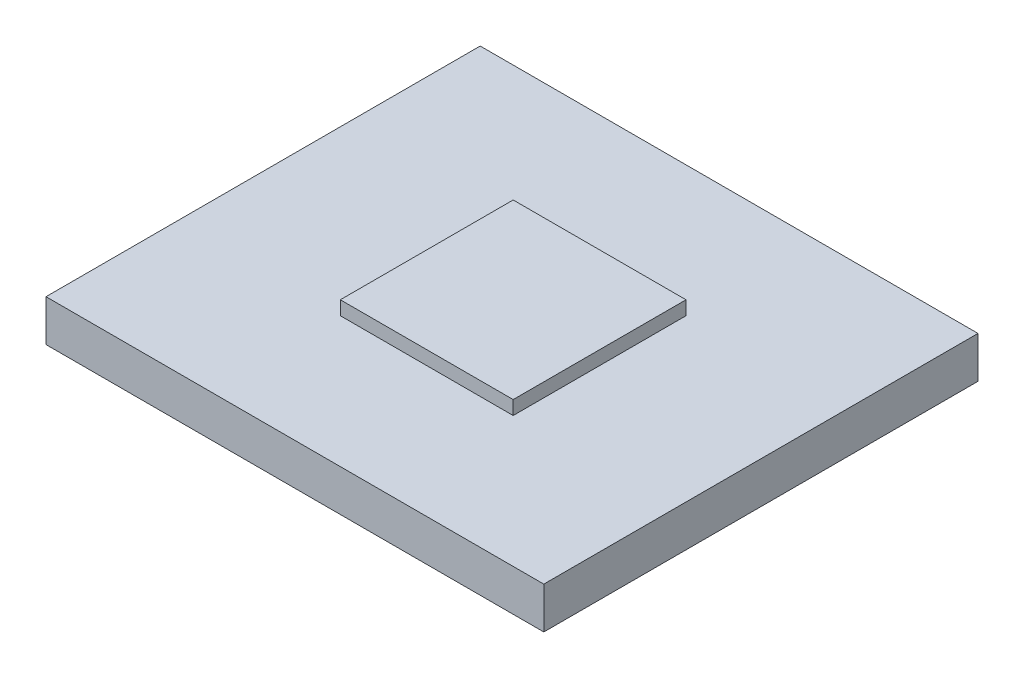
ISO-10303-21;
HEADER;
FILE_DESCRIPTION(('STEP AP214'),'2;1');
FILE_NAME('part.step','',(''),(''),'','','');
FILE_SCHEMA(('AUTOMOTIVE_DESIGN { 1 0 10303 214 1 1 1 1 }'));
ENDSEC;
DATA;
#1=APPLICATION_CONTEXT('core data for automotive mechanical design processes');
#2=APPLICATION_PROTOCOL_DEFINITION('international standard','automotive_design',2000,#1);
#3=PRODUCT_CONTEXT('',#1,'mechanical');
#4=PRODUCT('Part','Part','',(#3));
#5=PRODUCT_RELATED_PRODUCT_CATEGORY('part','',(#4));
#6=PRODUCT_DEFINITION_FORMATION('','',#4);
#7=PRODUCT_DEFINITION_CONTEXT('part definition',#1,'design');
#8=PRODUCT_DEFINITION('design','',#6,#7);
#9=PRODUCT_DEFINITION_SHAPE('','',#8);
#10=(LENGTH_UNIT() NAMED_UNIT(*) SI_UNIT(.MILLI.,.METRE.));
#11=(NAMED_UNIT(*) PLANE_ANGLE_UNIT() SI_UNIT($,.RADIAN.));
#12=(NAMED_UNIT(*) SI_UNIT($,.STERADIAN.) SOLID_ANGLE_UNIT());
#13=UNCERTAINTY_MEASURE_WITH_UNIT(LENGTH_MEASURE(1.E-05),#10,'distance_accuracy_value','');
#14=(GEOMETRIC_REPRESENTATION_CONTEXT(3) GLOBAL_UNCERTAINTY_ASSIGNED_CONTEXT((#13)) GLOBAL_UNIT_ASSIGNED_CONTEXT((#10,
#11,#12)) REPRESENTATION_CONTEXT('',''));
#15=CARTESIAN_POINT('',(0.,0.,0.));
#16=DIRECTION('',(0.,0.,1.));
#17=DIRECTION('',(1.,0.,0.));
#18=AXIS2_PLACEMENT_3D('',#15,#16,#17);
#19=CARTESIAN_POINT('',(0.,0.,0.));
#20=DIRECTION('',(0.,-1.,0.));
#21=DIRECTION('',(0.,0.,-1.));
#22=AXIS2_PLACEMENT_3D('',#19,#20,#21);
#23=PLANE('',#22);
#24=DIRECTION('',(-1.,0.,0.));
#25=VECTOR('',#24,1.);
#26=CARTESIAN_POINT('',(18.,0.,7.85));
#27=LINE('',#26,#25);
#28=CARTESIAN_POINT('',(18.,0.,7.85));
#29=VERTEX_POINT('',#28);
#30=CARTESIAN_POINT('',(0.,0.,7.85));
#31=VERTEX_POINT('',#30);
#32=EDGE_CURVE('E120',#29,#31,#27,.T.);
#33=ORIENTED_EDGE('',*,*,#32,.F.);
#34=DIRECTION('',(0.,0.,1.));
#35=VECTOR('',#34,1.);
#36=CARTESIAN_POINT('',(18.,0.,-7.85));
#37=LINE('',#36,#35);
#38=CARTESIAN_POINT('',(18.,0.,-7.85));
#39=VERTEX_POINT('',#38);
#40=EDGE_CURVE('E133',#39,#29,#37,.T.);
#41=ORIENTED_EDGE('',*,*,#40,.F.);
#42=DIRECTION('',(1.,0.,0.));
#43=VECTOR('',#42,1.);
#44=CARTESIAN_POINT('',(0.,0.,-7.85));
#45=LINE('',#44,#43);
#46=CARTESIAN_POINT('',(0.,0.,-7.85));
#47=VERTEX_POINT('',#46);
#48=EDGE_CURVE('E141',#47,#39,#45,.T.);
#49=ORIENTED_EDGE('',*,*,#48,.F.);
#50=DIRECTION('',(0.,0.,-1.));
#51=VECTOR('',#50,1.);
#52=CARTESIAN_POINT('',(0.,0.,7.85));
#53=LINE('',#52,#51);
#54=EDGE_CURVE('E123',#31,#47,#53,.T.);
#55=ORIENTED_EDGE('',*,*,#54,.F.);
#56=EDGE_LOOP('',(#33,#41,#49,#55));
#57=FACE_BOUND('',#56,.T.);
#58=DIRECTION('',(0.,0.,1.));
#59=VECTOR('',#58,1.);
#60=CARTESIAN_POINT('',(5.91771605031427,0.,3.125));
#61=LINE('',#60,#59);
#62=CARTESIAN_POINT('',(5.91771605031427,0.,-3.125));
#63=VERTEX_POINT('',#62);
#64=CARTESIAN_POINT('',(5.91771605031427,0.,3.125));
#65=VERTEX_POINT('',#64);
#66=EDGE_CURVE('E50',#63,#65,#61,.T.);
#67=ORIENTED_EDGE('',*,*,#66,.F.);
#68=DIRECTION('',(-1.,0.,0.));
#69=VECTOR('',#68,1.);
#70=CARTESIAN_POINT('',(5.91771605031427,0.,-3.125));
#71=LINE('',#70,#69);
#72=CARTESIAN_POINT('',(12.1677160503143,0.,-3.125));
#73=VERTEX_POINT('',#72);
#74=EDGE_CURVE('E54',#73,#63,#71,.T.);
#75=ORIENTED_EDGE('',*,*,#74,.F.);
#76=DIRECTION('',(0.,0.,-1.));
#77=VECTOR('',#76,1.);
#78=CARTESIAN_POINT('',(12.1677160503143,0.,-3.125));
#79=LINE('',#78,#77);
#80=CARTESIAN_POINT('',(12.1677160503143,0.,3.125));
#81=VERTEX_POINT('',#80);
#82=EDGE_CURVE('E262',#81,#73,#79,.T.);
#83=ORIENTED_EDGE('',*,*,#82,.F.);
#84=DIRECTION('',(1.,0.,0.));
#85=VECTOR('',#84,1.);
#86=CARTESIAN_POINT('',(12.1677160503143,0.,3.125));
#87=LINE('',#86,#85);
#88=EDGE_CURVE('E268',#65,#81,#87,.T.);
#89=ORIENTED_EDGE('',*,*,#88,.F.);
#90=EDGE_LOOP('',(#67,#75,#83,#89));
#91=FACE_BOUND('',#90,.T.);
#92=ADVANCED_FACE('F35',(#57,#91),#23,.F.);
#93=CARTESIAN_POINT('',(18.,-1.5,7.85));
#94=DIRECTION('',(0.,0.,-1.));
#95=DIRECTION('',(-1.,0.,0.));
#96=AXIS2_PLACEMENT_3D('',#93,#94,#95);
#97=PLANE('',#96);
#98=ORIENTED_EDGE('',*,*,#32,.T.);
#99=DIRECTION('',(0.,1.,0.));
#100=VECTOR('',#99,1.);
#101=CARTESIAN_POINT('',(0.,-1.5,7.85));
#102=LINE('',#101,#100);
#103=CARTESIAN_POINT('',(0.,-1.5,7.85));
#104=VERTEX_POINT('',#103);
#105=EDGE_CURVE('E11',#104,#31,#102,.T.);
#106=ORIENTED_EDGE('',*,*,#105,.F.);
#107=DIRECTION('',(-1.,0.,0.));
#108=VECTOR('',#107,1.);
#109=CARTESIAN_POINT('',(18.,-1.5,7.85));
#110=LINE('',#109,#108);
#111=CARTESIAN_POINT('',(18.,-1.5,7.85));
#112=VERTEX_POINT('',#111);
#113=EDGE_CURVE('E129',#112,#104,#110,.T.);
#114=ORIENTED_EDGE('',*,*,#113,.F.);
#115=DIRECTION('',(0.,1.,0.));
#116=VECTOR('',#115,1.);
#117=CARTESIAN_POINT('',(18.,-1.5,7.85));
#118=LINE('',#117,#116);
#119=EDGE_CURVE('E138',#112,#29,#118,.T.);
#120=ORIENTED_EDGE('',*,*,#119,.T.);
#121=EDGE_LOOP('',(#98,#106,#114,#120));
#122=FACE_BOUND('',#121,.T.);
#123=ADVANCED_FACE('F37',(#122),#97,.F.);
#124=CARTESIAN_POINT('',(0.,-1.5,7.85));
#125=DIRECTION('',(1.,0.,0.));
#126=DIRECTION('',(0.,0.,-1.));
#127=AXIS2_PLACEMENT_3D('',#124,#125,#126);
#128=PLANE('',#127);
#129=ORIENTED_EDGE('',*,*,#54,.T.);
#130=DIRECTION('',(0.,1.,0.));
#131=VECTOR('',#130,1.);
#132=CARTESIAN_POINT('',(0.,-1.5,-7.85));
#133=LINE('',#132,#131);
#134=CARTESIAN_POINT('',(0.,-1.5,-7.85));
#135=VERTEX_POINT('',#134);
#136=EDGE_CURVE('E43',#135,#47,#133,.T.);
#137=ORIENTED_EDGE('',*,*,#136,.F.);
#138=DIRECTION('',(0.,0.,-1.));
#139=VECTOR('',#138,1.);
#140=CARTESIAN_POINT('',(0.,-1.5,7.85));
#141=LINE('',#140,#139);
#142=EDGE_CURVE('E132',#104,#135,#141,.T.);
#143=ORIENTED_EDGE('',*,*,#142,.F.);
#144=ORIENTED_EDGE('',*,*,#105,.T.);
#145=EDGE_LOOP('',(#129,#137,#143,#144));
#146=FACE_BOUND('',#145,.T.);
#147=ADVANCED_FACE('F168',(#146),#128,.F.);
#148=CARTESIAN_POINT('',(0.,-1.5,-7.85));
#149=DIRECTION('',(0.,0.,1.));
#150=DIRECTION('',(1.,0.,0.));
#151=AXIS2_PLACEMENT_3D('',#148,#149,#150);
#152=PLANE('',#151);
#153=ORIENTED_EDGE('',*,*,#48,.T.);
#154=DIRECTION('',(0.,1.,0.));
#155=VECTOR('',#154,1.);
#156=CARTESIAN_POINT('',(18.,-1.5,-7.85));
#157=LINE('',#156,#155);
#158=CARTESIAN_POINT('',(18.,-1.5,-7.85));
#159=VERTEX_POINT('',#158);
#160=EDGE_CURVE('E146',#159,#39,#157,.T.);
#161=ORIENTED_EDGE('',*,*,#160,.F.);
#162=DIRECTION('',(1.,0.,0.));
#163=VECTOR('',#162,1.);
#164=CARTESIAN_POINT('',(0.,-1.5,-7.85));
#165=LINE('',#164,#163);
#166=EDGE_CURVE('E135',#135,#159,#165,.T.);
#167=ORIENTED_EDGE('',*,*,#166,.F.);
#168=ORIENTED_EDGE('',*,*,#136,.T.);
#169=EDGE_LOOP('',(#153,#161,#167,#168));
#170=FACE_BOUND('',#169,.T.);
#171=ADVANCED_FACE('F153',(#170),#152,.F.);
#172=CARTESIAN_POINT('',(18.,-1.5,-7.85));
#173=DIRECTION('',(-1.,0.,0.));
#174=DIRECTION('',(0.,0.,1.));
#175=AXIS2_PLACEMENT_3D('',#172,#173,#174);
#176=PLANE('',#175);
#177=ORIENTED_EDGE('',*,*,#40,.T.);
#178=ORIENTED_EDGE('',*,*,#119,.F.);
#179=DIRECTION('',(0.,0.,1.));
#180=VECTOR('',#179,1.);
#181=CARTESIAN_POINT('',(18.,-1.5,-7.85));
#182=LINE('',#181,#180);
#183=EDGE_CURVE('E137',#159,#112,#182,.T.);
#184=ORIENTED_EDGE('',*,*,#183,.F.);
#185=ORIENTED_EDGE('',*,*,#160,.T.);
#186=EDGE_LOOP('',(#177,#178,#184,#185));
#187=FACE_BOUND('',#186,.T.);
#188=ADVANCED_FACE('F161',(#187),#176,.F.);
#189=CARTESIAN_POINT('',(0.,-1.5,0.));
#190=DIRECTION('',(0.,-1.,0.));
#191=DIRECTION('',(0.,0.,-1.));
#192=AXIS2_PLACEMENT_3D('',#189,#190,#191);
#193=PLANE('',#192);
#194=ORIENTED_EDGE('',*,*,#113,.T.);
#195=ORIENTED_EDGE('',*,*,#142,.T.);
#196=ORIENTED_EDGE('',*,*,#166,.T.);
#197=ORIENTED_EDGE('',*,*,#183,.T.);
#198=EDGE_LOOP('',(#194,#195,#196,#197));
#199=FACE_BOUND('',#198,.T.);
#200=ADVANCED_FACE('F167',(#199),#193,.T.);
#201=CARTESIAN_POINT('',(5.91771605031427,0.5,3.125));
#202=DIRECTION('',(1.,0.,0.));
#203=DIRECTION('',(0.,0.,-1.));
#204=AXIS2_PLACEMENT_3D('',#201,#202,#203);
#205=PLANE('',#204);
#206=ORIENTED_EDGE('',*,*,#66,.T.);
#207=DIRECTION('',(0.,-1.,0.));
#208=VECTOR('',#207,1.);
#209=CARTESIAN_POINT('',(5.91771605031427,0.5,3.125));
#210=LINE('',#209,#208);
#211=CARTESIAN_POINT('',(5.91771605031427,0.5,3.125));
#212=VERTEX_POINT('',#211);
#213=EDGE_CURVE('E103',#212,#65,#210,.T.);
#214=ORIENTED_EDGE('',*,*,#213,.F.);
#215=DIRECTION('',(0.,0.,1.));
#216=VECTOR('',#215,1.);
#217=CARTESIAN_POINT('',(5.91771605031427,0.5,3.125));
#218=LINE('',#217,#216);
#219=CARTESIAN_POINT('',(5.91771605031427,0.5,-3.125));
#220=VERTEX_POINT('',#219);
#221=EDGE_CURVE('E109',#220,#212,#218,.T.);
#222=ORIENTED_EDGE('',*,*,#221,.F.);
#223=DIRECTION('',(0.,-1.,0.));
#224=VECTOR('',#223,1.);
#225=CARTESIAN_POINT('',(5.91771605031427,0.5,-3.125));
#226=LINE('',#225,#224);
#227=EDGE_CURVE('E260',#220,#63,#226,.T.);
#228=ORIENTED_EDGE('',*,*,#227,.T.);
#229=EDGE_LOOP('',(#206,#214,#222,#228));
#230=FACE_BOUND('',#229,.T.);
#231=ADVANCED_FACE('F119',(#230),#205,.F.);
#232=CARTESIAN_POINT('',(12.1677160503143,0.5,3.125));
#233=DIRECTION('',(0.,0.,-1.));
#234=DIRECTION('',(-1.,0.,0.));
#235=AXIS2_PLACEMENT_3D('',#232,#233,#234);
#236=PLANE('',#235);
#237=ORIENTED_EDGE('',*,*,#88,.T.);
#238=DIRECTION('',(0.,-1.,0.));
#239=VECTOR('',#238,1.);
#240=CARTESIAN_POINT('',(12.1677160503143,0.5,3.125));
#241=LINE('',#240,#239);
#242=CARTESIAN_POINT('',(12.1677160503143,0.5,3.125));
#243=VERTEX_POINT('',#242);
#244=EDGE_CURVE('E105',#243,#81,#241,.T.);
#245=ORIENTED_EDGE('',*,*,#244,.F.);
#246=DIRECTION('',(1.,0.,0.));
#247=VECTOR('',#246,1.);
#248=CARTESIAN_POINT('',(12.1677160503143,0.5,3.125));
#249=LINE('',#248,#247);
#250=EDGE_CURVE('E98',#212,#243,#249,.T.);
#251=ORIENTED_EDGE('',*,*,#250,.F.);
#252=ORIENTED_EDGE('',*,*,#213,.T.);
#253=EDGE_LOOP('',(#237,#245,#251,#252));
#254=FACE_BOUND('',#253,.T.);
#255=ADVANCED_FACE('F101',(#254),#236,.F.);
#256=CARTESIAN_POINT('',(12.1677160503143,0.5,-3.125));
#257=DIRECTION('',(-1.,0.,0.));
#258=DIRECTION('',(0.,0.,1.));
#259=AXIS2_PLACEMENT_3D('',#256,#257,#258);
#260=PLANE('',#259);
#261=ORIENTED_EDGE('',*,*,#82,.T.);
#262=DIRECTION('',(0.,-1.,0.));
#263=VECTOR('',#262,1.);
#264=CARTESIAN_POINT('',(12.1677160503143,0.5,-3.125));
#265=LINE('',#264,#263);
#266=CARTESIAN_POINT('',(12.1677160503143,0.5,-3.125));
#267=VERTEX_POINT('',#266);
#268=EDGE_CURVE('E125',#267,#73,#265,.T.);
#269=ORIENTED_EDGE('',*,*,#268,.F.);
#270=DIRECTION('',(0.,0.,-1.));
#271=VECTOR('',#270,1.);
#272=CARTESIAN_POINT('',(12.1677160503143,0.5,-3.125));
#273=LINE('',#272,#271);
#274=EDGE_CURVE('E108',#243,#267,#273,.T.);
#275=ORIENTED_EDGE('',*,*,#274,.F.);
#276=ORIENTED_EDGE('',*,*,#244,.T.);
#277=EDGE_LOOP('',(#261,#269,#275,#276));
#278=FACE_BOUND('',#277,.T.);
#279=ADVANCED_FACE('F192',(#278),#260,.F.);
#280=CARTESIAN_POINT('',(5.91771605031427,0.5,-3.125));
#281=DIRECTION('',(0.,0.,1.));
#282=DIRECTION('',(1.,0.,0.));
#283=AXIS2_PLACEMENT_3D('',#280,#281,#282);
#284=PLANE('',#283);
#285=ORIENTED_EDGE('',*,*,#74,.T.);
#286=ORIENTED_EDGE('',*,*,#227,.F.);
#287=DIRECTION('',(-1.,0.,0.));
#288=VECTOR('',#287,1.);
#289=CARTESIAN_POINT('',(5.91771605031427,0.5,-3.125));
#290=LINE('',#289,#288);
#291=EDGE_CURVE('E114',#267,#220,#290,.T.);
#292=ORIENTED_EDGE('',*,*,#291,.F.);
#293=ORIENTED_EDGE('',*,*,#268,.T.);
#294=EDGE_LOOP('',(#285,#286,#292,#293));
#295=FACE_BOUND('',#294,.T.);
#296=ADVANCED_FACE('F197',(#295),#284,.F.);
#297=CARTESIAN_POINT('',(0.,0.5,0.));
#298=DIRECTION('',(0.,-1.,0.));
#299=DIRECTION('',(0.,0.,-1.));
#300=AXIS2_PLACEMENT_3D('',#297,#298,#299);
#301=PLANE('',#300);
#302=ORIENTED_EDGE('',*,*,#221,.T.);
#303=ORIENTED_EDGE('',*,*,#250,.T.);
#304=ORIENTED_EDGE('',*,*,#274,.T.);
#305=ORIENTED_EDGE('',*,*,#291,.T.);
#306=EDGE_LOOP('',(#302,#303,#304,#305));
#307=FACE_BOUND('',#306,.T.);
#308=ADVANCED_FACE('F112',(#307),#301,.F.);
#309=CLOSED_SHELL('',(#92,#123,#147,#171,#188,#200,#231,#255,#279,#296,#308));
#310=MANIFOLD_SOLID_BREP('B2',#309);
#311=ADVANCED_BREP_SHAPE_REPRESENTATION('',(#18,#310),#14);
#312=SHAPE_DEFINITION_REPRESENTATION(#9,#311);
ENDSEC;
END-ISO-10303-21;
